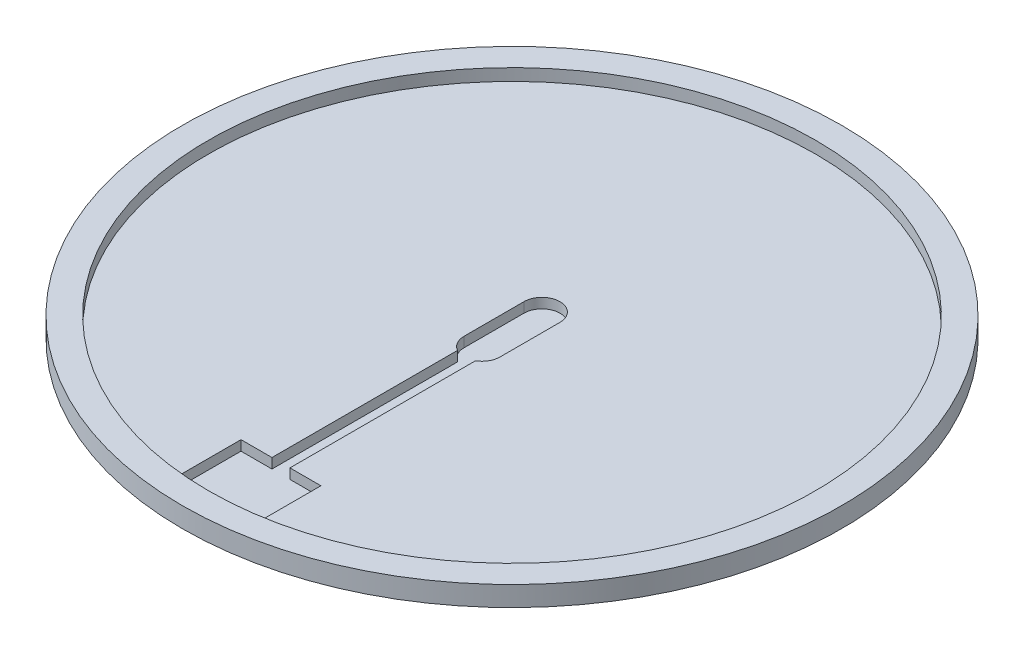
ISO-10303-21;
HEADER;
FILE_DESCRIPTION(('STEP AP214'),'2;1');
FILE_NAME('part.step','',(''),(''),'','','');
FILE_SCHEMA(('AUTOMOTIVE_DESIGN { 1 0 10303 214 1 1 1 1 }'));
ENDSEC;
DATA;
#1=APPLICATION_CONTEXT('core data for automotive mechanical design processes');
#2=APPLICATION_PROTOCOL_DEFINITION('international standard','automotive_design',2000,#1);
#3=PRODUCT_CONTEXT('',#1,'mechanical');
#4=PRODUCT('Part','Part','',(#3));
#5=PRODUCT_RELATED_PRODUCT_CATEGORY('part','',(#4));
#6=PRODUCT_DEFINITION_FORMATION('','',#4);
#7=PRODUCT_DEFINITION_CONTEXT('part definition',#1,'design');
#8=PRODUCT_DEFINITION('design','',#6,#7);
#9=PRODUCT_DEFINITION_SHAPE('','',#8);
#10=(LENGTH_UNIT() NAMED_UNIT(*) SI_UNIT(.MILLI.,.METRE.));
#11=(NAMED_UNIT(*) PLANE_ANGLE_UNIT() SI_UNIT($,.RADIAN.));
#12=(NAMED_UNIT(*) SI_UNIT($,.STERADIAN.) SOLID_ANGLE_UNIT());
#13=UNCERTAINTY_MEASURE_WITH_UNIT(LENGTH_MEASURE(1.E-05),#10,'distance_accuracy_value','');
#14=(GEOMETRIC_REPRESENTATION_CONTEXT(3) GLOBAL_UNCERTAINTY_ASSIGNED_CONTEXT((#13)) GLOBAL_UNIT_ASSIGNED_CONTEXT((#10,
#11,#12)) REPRESENTATION_CONTEXT('',''));
#15=CARTESIAN_POINT('',(0.,0.,0.));
#16=DIRECTION('',(0.,0.,1.));
#17=DIRECTION('',(1.,0.,0.));
#18=AXIS2_PLACEMENT_3D('',#15,#16,#17);
#19=CARTESIAN_POINT('',(0.,13.,0.));
#20=DIRECTION('',(0.,-1.,0.));
#21=DIRECTION('',(0.,0.,-1.));
#22=AXIS2_PLACEMENT_3D('',#19,#20,#21);
#23=CYLINDRICAL_SURFACE('',#22,165.);
#24=CARTESIAN_POINT('',(0.,13.,0.));
#25=DIRECTION('',(0.,1.,0.));
#26=DIRECTION('',(0.,0.,1.));
#27=AXIS2_PLACEMENT_3D('',#24,#25,#26);
#28=CIRCLE('',#27,165.);
#29=CARTESIAN_POINT('',(0.,13.,165.));
#30=VERTEX_POINT('',#29);
#31=EDGE_CURVE('E240',#30,#30,#28,.T.);
#32=ORIENTED_EDGE('',*,*,#31,.F.);
#33=EDGE_LOOP('',(#32));
#34=FACE_BOUND('',#33,.T.);
#35=CARTESIAN_POINT('',(0.,3.,0.));
#36=DIRECTION('',(0.,-1.,0.));
#37=DIRECTION('',(0.,0.,-1.));
#38=AXIS2_PLACEMENT_3D('',#35,#36,#37);
#39=CIRCLE('',#38,165.);
#40=CARTESIAN_POINT('',(0.,3.,-165.));
#41=VERTEX_POINT('',#40);
#42=EDGE_CURVE('E234',#41,#41,#39,.T.);
#43=ORIENTED_EDGE('',*,*,#42,.F.);
#44=EDGE_LOOP('',(#43));
#45=FACE_BOUND('',#44,.T.);
#46=ADVANCED_FACE('F33',(#34,#45),#23,.T.);
#47=CARTESIAN_POINT('',(0.,13.,0.));
#48=DIRECTION('',(0.,1.,0.));
#49=DIRECTION('',(0.,0.,1.));
#50=AXIS2_PLACEMENT_3D('',#47,#48,#49);
#51=PLANE('',#50);
#52=CARTESIAN_POINT('',(0.,13.,0.));
#53=DIRECTION('',(0.,1.,0.));
#54=DIRECTION('',(0.,0.,1.));
#55=AXIS2_PLACEMENT_3D('',#52,#53,#54);
#56=CIRCLE('',#55,152.);
#57=CARTESIAN_POINT('',(0.,13.,152.));
#58=VERTEX_POINT('',#57);
#59=EDGE_CURVE('E227',#58,#58,#56,.T.);
#60=ORIENTED_EDGE('',*,*,#59,.F.);
#61=EDGE_LOOP('',(#60));
#62=FACE_BOUND('',#61,.T.);
#63=ORIENTED_EDGE('',*,*,#31,.T.);
#64=EDGE_LOOP('',(#63));
#65=FACE_BOUND('',#64,.T.);
#66=ADVANCED_FACE('F315',(#62,#65),#51,.T.);
#67=CARTESIAN_POINT('',(0.,3.,0.));
#68=DIRECTION('',(0.,-1.,0.));
#69=DIRECTION('',(0.,0.,-1.));
#70=AXIS2_PLACEMENT_3D('',#67,#68,#69);
#71=PLANE('',#70);
#72=DIRECTION('',(0.,0.,1.));
#73=VECTOR('',#72,1.);
#74=CARTESIAN_POINT('',(20.,3.,0.));
#75=LINE('',#74,#73);
#76=CARTESIAN_POINT('',(20.,3.,147.651616990807));
#77=VERTEX_POINT('',#76);
#78=CARTESIAN_POINT('',(20.,3.,150.678465614699));
#79=VERTEX_POINT('',#78);
#80=EDGE_CURVE('E225',#77,#79,#75,.T.);
#81=ORIENTED_EDGE('',*,*,#80,.F.);
#82=CARTESIAN_POINT('',(0.,3.,0.));
#83=DIRECTION('',(0.,-1.,0.));
#84=DIRECTION('',(0.,0.,-1.));
#85=AXIS2_PLACEMENT_3D('',#82,#83,#84);
#86=CIRCLE('',#85,149.);
#87=CARTESIAN_POINT('',(-20.,3.,147.651616990807));
#88=VERTEX_POINT('',#87);
#89=EDGE_CURVE('E231',#88,#77,#86,.T.);
#90=ORIENTED_EDGE('',*,*,#89,.F.);
#91=DIRECTION('',(0.,0.,-1.));
#92=VECTOR('',#91,1.);
#93=CARTESIAN_POINT('',(-20.,3.,0.));
#94=LINE('',#93,#92);
#95=CARTESIAN_POINT('',(-20.,3.,150.678465614699));
#96=VERTEX_POINT('',#95);
#97=EDGE_CURVE('E206',#96,#88,#94,.T.);
#98=ORIENTED_EDGE('',*,*,#97,.F.);
#99=CARTESIAN_POINT('',(0.,3.,0.));
#100=DIRECTION('',(0.,-1.,0.));
#101=DIRECTION('',(0.,0.,-1.));
#102=AXIS2_PLACEMENT_3D('',#99,#100,#101);
#103=CIRCLE('',#102,152.);
#104=EDGE_CURVE('E11',#79,#96,#103,.T.);
#105=ORIENTED_EDGE('',*,*,#104,.F.);
#106=EDGE_LOOP('',(#81,#90,#98,#105));
#107=FACE_BOUND('',#106,.T.);
#108=ORIENTED_EDGE('',*,*,#42,.T.);
#109=EDGE_LOOP('',(#108));
#110=FACE_BOUND('',#109,.T.);
#111=ADVANCED_FACE('F312',(#107,#110),#71,.T.);
#112=CARTESIAN_POINT('',(0.,3.,0.));
#113=DIRECTION('',(0.,-1.,0.));
#114=DIRECTION('',(0.,0.,-1.));
#115=AXIS2_PLACEMENT_3D('',#112,#113,#114);
#116=CYLINDRICAL_SURFACE('',#115,149.);
#117=DIRECTION('',(0.,-1.,0.));
#118=VECTOR('',#117,1.);
#119=CARTESIAN_POINT('',(20.,3.,147.651616990807));
#120=LINE('',#119,#118);
#121=CARTESIAN_POINT('',(20.,2.,147.651616990807));
#122=VERTEX_POINT('',#121);
#123=EDGE_CURVE('E42',#122,#77,#120,.F.);
#124=ORIENTED_EDGE('',*,*,#123,.F.);
#125=CARTESIAN_POINT('',(0.,2.,0.));
#126=DIRECTION('',(0.,-1.,0.));
#127=DIRECTION('',(0.,0.,-1.));
#128=AXIS2_PLACEMENT_3D('',#125,#126,#127);
#129=CIRCLE('',#128,149.);
#130=CARTESIAN_POINT('',(-20.,2.,147.651616990807));
#131=VERTEX_POINT('',#130);
#132=EDGE_CURVE('E243',#131,#122,#129,.F.);
#133=ORIENTED_EDGE('',*,*,#132,.F.);
#134=DIRECTION('',(0.,-1.,0.));
#135=VECTOR('',#134,1.);
#136=CARTESIAN_POINT('',(-20.,3.,147.651616990807));
#137=LINE('',#136,#135);
#138=EDGE_CURVE('E245',#88,#131,#137,.T.);
#139=ORIENTED_EDGE('',*,*,#138,.F.);
#140=ORIENTED_EDGE('',*,*,#89,.T.);
#141=EDGE_LOOP('',(#124,#133,#139,#140));
#142=FACE_BOUND('',#141,.T.);
#143=CARTESIAN_POINT('',(0.,0.,0.));
#144=DIRECTION('',(0.,-1.,0.));
#145=DIRECTION('',(0.,0.,-1.));
#146=AXIS2_PLACEMENT_3D('',#143,#144,#145);
#147=CIRCLE('',#146,149.);
#148=CARTESIAN_POINT('',(0.,0.,-149.));
#149=VERTEX_POINT('',#148);
#150=EDGE_CURVE('E235',#149,#149,#147,.T.);
#151=ORIENTED_EDGE('',*,*,#150,.F.);
#152=EDGE_LOOP('',(#151));
#153=FACE_BOUND('',#152,.T.);
#154=ADVANCED_FACE('F307',(#142,#153),#116,.T.);
#155=CARTESIAN_POINT('',(0.,0.,0.));
#156=DIRECTION('',(0.,1.,0.));
#157=DIRECTION('',(0.,0.,1.));
#158=AXIS2_PLACEMENT_3D('',#155,#156,#157);
#159=PLANE('',#158);
#160=ORIENTED_EDGE('',*,*,#150,.T.);
#161=EDGE_LOOP('',(#160));
#162=FACE_BOUND('',#161,.T.);
#163=ADVANCED_FACE('F332',(#162),#159,.F.);
#164=CARTESIAN_POINT('',(0.,7.,0.));
#165=DIRECTION('',(0.,1.,0.));
#166=DIRECTION('',(0.,0.,1.));
#167=AXIS2_PLACEMENT_3D('',#164,#165,#166);
#168=CYLINDRICAL_SURFACE('',#167,152.);
#169=CARTESIAN_POINT('',(0.,7.,0.));
#170=DIRECTION('',(0.,1.,0.));
#171=DIRECTION('',(0.,0.,1.));
#172=AXIS2_PLACEMENT_3D('',#169,#170,#171);
#173=CIRCLE('',#172,152.);
#174=CARTESIAN_POINT('',(20.,7.,150.678465614699));
#175=VERTEX_POINT('',#174);
#176=CARTESIAN_POINT('',(-20.,7.,150.678465614699));
#177=VERTEX_POINT('',#176);
#178=EDGE_CURVE('E230',#175,#177,#173,.T.);
#179=ORIENTED_EDGE('',*,*,#178,.F.);
#180=DIRECTION('',(0.,1.,0.));
#181=VECTOR('',#180,1.);
#182=CARTESIAN_POINT('',(20.,2.,150.678465614699));
#183=LINE('',#182,#181);
#184=EDGE_CURVE('E215',#79,#175,#183,.T.);
#185=ORIENTED_EDGE('',*,*,#184,.F.);
#186=ORIENTED_EDGE('',*,*,#104,.T.);
#187=DIRECTION('',(0.,1.,0.));
#188=VECTOR('',#187,1.);
#189=CARTESIAN_POINT('',(-20.,2.,150.678465614699));
#190=LINE('',#189,#188);
#191=EDGE_CURVE('E218',#96,#177,#190,.T.);
#192=ORIENTED_EDGE('',*,*,#191,.T.);
#193=EDGE_LOOP('',(#179,#185,#186,#192));
#194=FACE_BOUND('',#193,.T.);
#195=ORIENTED_EDGE('',*,*,#59,.T.);
#196=EDGE_LOOP('',(#195));
#197=FACE_BOUND('',#196,.T.);
#198=ADVANCED_FACE('F275',(#194,#197),#168,.F.);
#199=CARTESIAN_POINT('',(0.,7.,0.));
#200=DIRECTION('',(0.,1.,0.));
#201=DIRECTION('',(0.,0.,1.));
#202=AXIS2_PLACEMENT_3D('',#199,#200,#201);
#203=PLANE('',#202);
#204=DIRECTION('',(0.,0.,1.));
#205=VECTOR('',#204,1.);
#206=CARTESIAN_POINT('',(-20.,7.,115.678465614699));
#207=LINE('',#206,#205);
#208=CARTESIAN_POINT('',(-20.,7.,115.678465614699));
#209=VERTEX_POINT('',#208);
#210=EDGE_CURVE('E194',#209,#177,#207,.T.);
#211=ORIENTED_EDGE('',*,*,#210,.F.);
#212=DIRECTION('',(-1.,0.,0.));
#213=VECTOR('',#212,1.);
#214=CARTESIAN_POINT('',(-4.5,7.,115.678465614699));
#215=LINE('',#214,#213);
#216=CARTESIAN_POINT('',(-4.5,7.,115.678465614699));
#217=VERTEX_POINT('',#216);
#218=EDGE_CURVE('E192',#217,#209,#215,.T.);
#219=ORIENTED_EDGE('',*,*,#218,.F.);
#220=DIRECTION('',(0.,0.,1.));
#221=VECTOR('',#220,1.);
#222=CARTESIAN_POINT('',(-4.5,7.,115.678465614699));
#223=LINE('',#222,#221);
#224=CARTESIAN_POINT('',(-4.5,7.,22.7942286340599));
#225=VERTEX_POINT('',#224);
#226=EDGE_CURVE('E189',#225,#217,#223,.T.);
#227=ORIENTED_EDGE('',*,*,#226,.F.);
#228=CARTESIAN_POINT('',(0.,7.,15.));
#229=DIRECTION('',(0.,1.,0.));
#230=DIRECTION('',(0.,0.,1.));
#231=AXIS2_PLACEMENT_3D('',#228,#229,#230);
#232=CIRCLE('',#231,9.);
#233=CARTESIAN_POINT('',(-9.,7.,15.));
#234=VERTEX_POINT('',#233);
#235=EDGE_CURVE('E186',#234,#225,#232,.T.);
#236=ORIENTED_EDGE('',*,*,#235,.F.);
#237=DIRECTION('',(0.,0.,1.));
#238=VECTOR('',#237,1.);
#239=CARTESIAN_POINT('',(-9.,7.,15.));
#240=LINE('',#239,#238);
#241=CARTESIAN_POINT('',(-9.,7.,-15.));
#242=VERTEX_POINT('',#241);
#243=EDGE_CURVE('E184',#242,#234,#240,.T.);
#244=ORIENTED_EDGE('',*,*,#243,.F.);
#245=CARTESIAN_POINT('',(0.,7.,-15.));
#246=DIRECTION('',(0.,1.,0.));
#247=DIRECTION('',(0.,0.,-1.));
#248=AXIS2_PLACEMENT_3D('',#245,#246,#247);
#249=CIRCLE('',#248,9.);
#250=CARTESIAN_POINT('',(9.,7.,-15.));
#251=VERTEX_POINT('',#250);
#252=EDGE_CURVE('E143',#251,#242,#249,.T.);
#253=ORIENTED_EDGE('',*,*,#252,.F.);
#254=DIRECTION('',(0.,0.,-1.));
#255=VECTOR('',#254,1.);
#256=CARTESIAN_POINT('',(9.,7.,15.));
#257=LINE('',#256,#255);
#258=CARTESIAN_POINT('',(9.,7.,15.));
#259=VERTEX_POINT('',#258);
#260=EDGE_CURVE('E160',#259,#251,#257,.T.);
#261=ORIENTED_EDGE('',*,*,#260,.F.);
#262=CARTESIAN_POINT('',(0.,7.,15.));
#263=DIRECTION('',(0.,1.,0.));
#264=DIRECTION('',(0.,0.,1.));
#265=AXIS2_PLACEMENT_3D('',#262,#263,#264);
#266=CIRCLE('',#265,9.);
#267=CARTESIAN_POINT('',(4.5,7.,22.7942286340599));
#268=VERTEX_POINT('',#267);
#269=EDGE_CURVE('E50',#268,#259,#266,.T.);
#270=ORIENTED_EDGE('',*,*,#269,.F.);
#271=DIRECTION('',(0.,0.,-1.));
#272=VECTOR('',#271,1.);
#273=CARTESIAN_POINT('',(4.5,7.,115.678465614699));
#274=LINE('',#273,#272);
#275=CARTESIAN_POINT('',(4.5,7.,115.678465614699));
#276=VERTEX_POINT('',#275);
#277=EDGE_CURVE('E200',#276,#268,#274,.T.);
#278=ORIENTED_EDGE('',*,*,#277,.F.);
#279=DIRECTION('',(-1.,0.,0.));
#280=VECTOR('',#279,1.);
#281=CARTESIAN_POINT('',(4.5,7.,115.678465614699));
#282=LINE('',#281,#280);
#283=CARTESIAN_POINT('',(20.,7.,115.678465614699));
#284=VERTEX_POINT('',#283);
#285=EDGE_CURVE('E197',#284,#276,#282,.T.);
#286=ORIENTED_EDGE('',*,*,#285,.F.);
#287=DIRECTION('',(0.,0.,-1.));
#288=VECTOR('',#287,1.);
#289=CARTESIAN_POINT('',(20.,7.,115.678465614699));
#290=LINE('',#289,#288);
#291=EDGE_CURVE('E36',#175,#284,#290,.T.);
#292=ORIENTED_EDGE('',*,*,#291,.F.);
#293=ORIENTED_EDGE('',*,*,#178,.T.);
#294=EDGE_LOOP('',(#211,#219,#227,#236,#244,#253,#261,#270,#278,#286,#292,#293));
#295=FACE_BOUND('',#294,.T.);
#296=ADVANCED_FACE('F273',(#295),#203,.T.);
#297=CARTESIAN_POINT('',(0.,2.,-15.));
#298=DIRECTION('',(0.,1.,0.));
#299=DIRECTION('',(0.,0.,1.));
#300=AXIS2_PLACEMENT_3D('',#297,#298,#299);
#301=CYLINDRICAL_SURFACE('',#300,9.);
#302=ORIENTED_EDGE('',*,*,#252,.T.);
#303=DIRECTION('',(0.,1.,0.));
#304=VECTOR('',#303,1.);
#305=CARTESIAN_POINT('',(-9.,2.,-15.));
#306=LINE('',#305,#304);
#307=CARTESIAN_POINT('',(-9.,2.,-15.));
#308=VERTEX_POINT('',#307);
#309=EDGE_CURVE('E136',#308,#242,#306,.T.);
#310=ORIENTED_EDGE('',*,*,#309,.F.);
#311=CARTESIAN_POINT('',(0.,2.,-15.));
#312=DIRECTION('',(0.,1.,0.));
#313=DIRECTION('',(0.,0.,-1.));
#314=AXIS2_PLACEMENT_3D('',#311,#312,#313);
#315=CIRCLE('',#314,9.);
#316=CARTESIAN_POINT('',(9.,2.,-15.));
#317=VERTEX_POINT('',#316);
#318=EDGE_CURVE('E140',#317,#308,#315,.T.);
#319=ORIENTED_EDGE('',*,*,#318,.F.);
#320=DIRECTION('',(0.,1.,0.));
#321=VECTOR('',#320,1.);
#322=CARTESIAN_POINT('',(9.,2.,-15.));
#323=LINE('',#322,#321);
#324=EDGE_CURVE('E204',#317,#251,#323,.T.);
#325=ORIENTED_EDGE('',*,*,#324,.T.);
#326=EDGE_LOOP('',(#302,#310,#319,#325));
#327=FACE_BOUND('',#326,.T.);
#328=ADVANCED_FACE('F138',(#327),#301,.F.);
#329=CARTESIAN_POINT('',(9.,2.,15.));
#330=DIRECTION('',(1.,0.,0.));
#331=DIRECTION('',(0.,0.,-1.));
#332=AXIS2_PLACEMENT_3D('',#329,#330,#331);
#333=PLANE('',#332);
#334=ORIENTED_EDGE('',*,*,#260,.T.);
#335=ORIENTED_EDGE('',*,*,#324,.F.);
#336=DIRECTION('',(0.,0.,-1.));
#337=VECTOR('',#336,1.);
#338=CARTESIAN_POINT('',(9.,2.,15.));
#339=LINE('',#338,#337);
#340=CARTESIAN_POINT('',(9.,2.,15.));
#341=VERTEX_POINT('',#340);
#342=EDGE_CURVE('E148',#341,#317,#339,.T.);
#343=ORIENTED_EDGE('',*,*,#342,.F.);
#344=DIRECTION('',(0.,1.,0.));
#345=VECTOR('',#344,1.);
#346=CARTESIAN_POINT('',(9.,2.,15.));
#347=LINE('',#346,#345);
#348=EDGE_CURVE('E207',#341,#259,#347,.T.);
#349=ORIENTED_EDGE('',*,*,#348,.T.);
#350=EDGE_LOOP('',(#334,#335,#343,#349));
#351=FACE_BOUND('',#350,.T.);
#352=ADVANCED_FACE('F294',(#351),#333,.F.);
#353=CARTESIAN_POINT('',(0.,2.,15.));
#354=DIRECTION('',(0.,1.,0.));
#355=DIRECTION('',(0.,0.,1.));
#356=AXIS2_PLACEMENT_3D('',#353,#354,#355);
#357=CYLINDRICAL_SURFACE('',#356,9.);
#358=ORIENTED_EDGE('',*,*,#269,.T.);
#359=ORIENTED_EDGE('',*,*,#348,.F.);
#360=CARTESIAN_POINT('',(0.,2.,15.));
#361=DIRECTION('',(0.,1.,0.));
#362=DIRECTION('',(0.,0.,1.));
#363=AXIS2_PLACEMENT_3D('',#360,#361,#362);
#364=CIRCLE('',#363,9.);
#365=CARTESIAN_POINT('',(4.5,2.,22.7942286340599));
#366=VERTEX_POINT('',#365);
#367=EDGE_CURVE('E180',#366,#341,#364,.T.);
#368=ORIENTED_EDGE('',*,*,#367,.F.);
#369=DIRECTION('',(0.,1.,0.));
#370=VECTOR('',#369,1.);
#371=CARTESIAN_POINT('',(4.5,2.,22.7942286340599));
#372=LINE('',#371,#370);
#373=EDGE_CURVE('E209',#366,#268,#372,.T.);
#374=ORIENTED_EDGE('',*,*,#373,.T.);
#375=EDGE_LOOP('',(#358,#359,#368,#374));
#376=FACE_BOUND('',#375,.T.);
#377=ADVANCED_FACE('F296',(#376),#357,.F.);
#378=CARTESIAN_POINT('',(4.5,2.,115.678465614699));
#379=DIRECTION('',(1.,0.,0.));
#380=DIRECTION('',(0.,0.,-1.));
#381=AXIS2_PLACEMENT_3D('',#378,#379,#380);
#382=PLANE('',#381);
#383=ORIENTED_EDGE('',*,*,#277,.T.);
#384=ORIENTED_EDGE('',*,*,#373,.F.);
#385=DIRECTION('',(0.,0.,-1.));
#386=VECTOR('',#385,1.);
#387=CARTESIAN_POINT('',(4.5,2.,115.678465614699));
#388=LINE('',#387,#386);
#389=CARTESIAN_POINT('',(4.5,2.,115.678465614699));
#390=VERTEX_POINT('',#389);
#391=EDGE_CURVE('E177',#390,#366,#388,.T.);
#392=ORIENTED_EDGE('',*,*,#391,.F.);
#393=DIRECTION('',(0.,1.,0.));
#394=VECTOR('',#393,1.);
#395=CARTESIAN_POINT('',(4.5,2.,115.678465614699));
#396=LINE('',#395,#394);
#397=EDGE_CURVE('E211',#390,#276,#396,.T.);
#398=ORIENTED_EDGE('',*,*,#397,.T.);
#399=EDGE_LOOP('',(#383,#384,#392,#398));
#400=FACE_BOUND('',#399,.T.);
#401=ADVANCED_FACE('F300',(#400),#382,.F.);
#402=CARTESIAN_POINT('',(4.5,2.,115.678465614699));
#403=DIRECTION('',(0.,0.,-1.));
#404=DIRECTION('',(-1.,0.,0.));
#405=AXIS2_PLACEMENT_3D('',#402,#403,#404);
#406=PLANE('',#405);
#407=ORIENTED_EDGE('',*,*,#285,.T.);
#408=ORIENTED_EDGE('',*,*,#397,.F.);
#409=DIRECTION('',(-1.,0.,0.));
#410=VECTOR('',#409,1.);
#411=CARTESIAN_POINT('',(4.5,2.,115.678465614699));
#412=LINE('',#411,#410);
#413=CARTESIAN_POINT('',(20.,2.,115.678465614699));
#414=VERTEX_POINT('',#413);
#415=EDGE_CURVE('E174',#414,#390,#412,.T.);
#416=ORIENTED_EDGE('',*,*,#415,.F.);
#417=DIRECTION('',(0.,1.,0.));
#418=VECTOR('',#417,1.);
#419=CARTESIAN_POINT('',(20.,2.,115.678465614699));
#420=LINE('',#419,#418);
#421=EDGE_CURVE('E213',#414,#284,#420,.T.);
#422=ORIENTED_EDGE('',*,*,#421,.T.);
#423=EDGE_LOOP('',(#407,#408,#416,#422));
#424=FACE_BOUND('',#423,.T.);
#425=ADVANCED_FACE('F302',(#424),#406,.F.);
#426=CARTESIAN_POINT('',(20.,2.,115.678465614699));
#427=DIRECTION('',(1.,0.,0.));
#428=DIRECTION('',(0.,0.,-1.));
#429=AXIS2_PLACEMENT_3D('',#426,#427,#428);
#430=PLANE('',#429);
#431=ORIENTED_EDGE('',*,*,#80,.T.);
#432=ORIENTED_EDGE('',*,*,#184,.T.);
#433=ORIENTED_EDGE('',*,*,#291,.T.);
#434=ORIENTED_EDGE('',*,*,#421,.F.);
#435=DIRECTION('',(0.,0.,-1.));
#436=VECTOR('',#435,1.);
#437=CARTESIAN_POINT('',(20.,2.,115.678465614699));
#438=LINE('',#437,#436);
#439=EDGE_CURVE('E172',#122,#414,#438,.T.);
#440=ORIENTED_EDGE('',*,*,#439,.F.);
#441=ORIENTED_EDGE('',*,*,#123,.T.);
#442=EDGE_LOOP('',(#431,#432,#433,#434,#440,#441));
#443=FACE_BOUND('',#442,.T.);
#444=ADVANCED_FACE('F264',(#443),#430,.F.);
#445=CARTESIAN_POINT('',(-20.,2.,115.678465614699));
#446=DIRECTION('',(-1.,0.,0.));
#447=DIRECTION('',(0.,0.,1.));
#448=AXIS2_PLACEMENT_3D('',#445,#446,#447);
#449=PLANE('',#448);
#450=ORIENTED_EDGE('',*,*,#97,.T.);
#451=ORIENTED_EDGE('',*,*,#138,.T.);
#452=DIRECTION('',(0.,0.,1.));
#453=VECTOR('',#452,1.);
#454=CARTESIAN_POINT('',(-20.,2.,115.678465614699));
#455=LINE('',#454,#453);
#456=CARTESIAN_POINT('',(-20.,2.,115.678465614699));
#457=VERTEX_POINT('',#456);
#458=EDGE_CURVE('E58',#457,#131,#455,.T.);
#459=ORIENTED_EDGE('',*,*,#458,.F.);
#460=DIRECTION('',(0.,1.,0.));
#461=VECTOR('',#460,1.);
#462=CARTESIAN_POINT('',(-20.,2.,115.678465614699));
#463=LINE('',#462,#461);
#464=EDGE_CURVE('E216',#457,#209,#463,.T.);
#465=ORIENTED_EDGE('',*,*,#464,.T.);
#466=ORIENTED_EDGE('',*,*,#210,.T.);
#467=ORIENTED_EDGE('',*,*,#191,.F.);
#468=EDGE_LOOP('',(#450,#451,#459,#465,#466,#467));
#469=FACE_BOUND('',#468,.T.);
#470=ADVANCED_FACE('F280',(#469),#449,.F.);
#471=CARTESIAN_POINT('',(-4.5,2.,115.678465614699));
#472=DIRECTION('',(0.,0.,-1.));
#473=DIRECTION('',(-1.,0.,0.));
#474=AXIS2_PLACEMENT_3D('',#471,#472,#473);
#475=PLANE('',#474);
#476=ORIENTED_EDGE('',*,*,#218,.T.);
#477=ORIENTED_EDGE('',*,*,#464,.F.);
#478=DIRECTION('',(-1.,0.,0.));
#479=VECTOR('',#478,1.);
#480=CARTESIAN_POINT('',(-4.5,2.,115.678465614699));
#481=LINE('',#480,#479);
#482=CARTESIAN_POINT('',(-4.5,2.,115.678465614699));
#483=VERTEX_POINT('',#482);
#484=EDGE_CURVE('E169',#483,#457,#481,.T.);
#485=ORIENTED_EDGE('',*,*,#484,.F.);
#486=DIRECTION('',(0.,1.,0.));
#487=VECTOR('',#486,1.);
#488=CARTESIAN_POINT('',(-4.5,2.,115.678465614699));
#489=LINE('',#488,#487);
#490=EDGE_CURVE('E219',#483,#217,#489,.T.);
#491=ORIENTED_EDGE('',*,*,#490,.T.);
#492=EDGE_LOOP('',(#476,#477,#485,#491));
#493=FACE_BOUND('',#492,.T.);
#494=ADVANCED_FACE('F285',(#493),#475,.F.);
#495=CARTESIAN_POINT('',(-4.5,2.,115.678465614699));
#496=DIRECTION('',(-1.,0.,0.));
#497=DIRECTION('',(0.,0.,1.));
#498=AXIS2_PLACEMENT_3D('',#495,#496,#497);
#499=PLANE('',#498);
#500=ORIENTED_EDGE('',*,*,#226,.T.);
#501=ORIENTED_EDGE('',*,*,#490,.F.);
#502=DIRECTION('',(0.,0.,1.));
#503=VECTOR('',#502,1.);
#504=CARTESIAN_POINT('',(-4.5,2.,115.678465614699));
#505=LINE('',#504,#503);
#506=CARTESIAN_POINT('',(-4.5,2.,22.7942286340599));
#507=VERTEX_POINT('',#506);
#508=EDGE_CURVE('E166',#507,#483,#505,.T.);
#509=ORIENTED_EDGE('',*,*,#508,.F.);
#510=DIRECTION('',(0.,1.,0.));
#511=VECTOR('',#510,1.);
#512=CARTESIAN_POINT('',(-4.5,2.,22.7942286340599));
#513=LINE('',#512,#511);
#514=EDGE_CURVE('E221',#507,#225,#513,.T.);
#515=ORIENTED_EDGE('',*,*,#514,.T.);
#516=EDGE_LOOP('',(#500,#501,#509,#515));
#517=FACE_BOUND('',#516,.T.);
#518=ADVANCED_FACE('F289',(#517),#499,.F.);
#519=CARTESIAN_POINT('',(0.,2.,15.));
#520=DIRECTION('',(0.,1.,0.));
#521=DIRECTION('',(0.,0.,1.));
#522=AXIS2_PLACEMENT_3D('',#519,#520,#521);
#523=CYLINDRICAL_SURFACE('',#522,9.);
#524=ORIENTED_EDGE('',*,*,#235,.T.);
#525=ORIENTED_EDGE('',*,*,#514,.F.);
#526=CARTESIAN_POINT('',(0.,2.,15.));
#527=DIRECTION('',(0.,1.,0.));
#528=DIRECTION('',(0.,0.,1.));
#529=AXIS2_PLACEMENT_3D('',#526,#527,#528);
#530=CIRCLE('',#529,9.);
#531=CARTESIAN_POINT('',(-9.,2.,15.));
#532=VERTEX_POINT('',#531);
#533=EDGE_CURVE('E155',#532,#507,#530,.T.);
#534=ORIENTED_EDGE('',*,*,#533,.F.);
#535=DIRECTION('',(0.,1.,0.));
#536=VECTOR('',#535,1.);
#537=CARTESIAN_POINT('',(-9.,2.,15.));
#538=LINE('',#537,#536);
#539=EDGE_CURVE('E147',#532,#234,#538,.T.);
#540=ORIENTED_EDGE('',*,*,#539,.T.);
#541=EDGE_LOOP('',(#524,#525,#534,#540));
#542=FACE_BOUND('',#541,.T.);
#543=ADVANCED_FACE('F291',(#542),#523,.F.);
#544=CARTESIAN_POINT('',(-9.,2.,15.));
#545=DIRECTION('',(-1.,0.,0.));
#546=DIRECTION('',(0.,0.,1.));
#547=AXIS2_PLACEMENT_3D('',#544,#545,#546);
#548=PLANE('',#547);
#549=ORIENTED_EDGE('',*,*,#243,.T.);
#550=ORIENTED_EDGE('',*,*,#539,.F.);
#551=DIRECTION('',(0.,0.,1.));
#552=VECTOR('',#551,1.);
#553=CARTESIAN_POINT('',(-9.,2.,15.));
#554=LINE('',#553,#552);
#555=EDGE_CURVE('E151',#308,#532,#554,.T.);
#556=ORIENTED_EDGE('',*,*,#555,.F.);
#557=ORIENTED_EDGE('',*,*,#309,.T.);
#558=EDGE_LOOP('',(#549,#550,#556,#557));
#559=FACE_BOUND('',#558,.T.);
#560=ADVANCED_FACE('F152',(#559),#548,.F.);
#561=CARTESIAN_POINT('',(0.,2.,-15.));
#562=DIRECTION('',(0.,-1.,0.));
#563=DIRECTION('',(0.,0.,-1.));
#564=AXIS2_PLACEMENT_3D('',#561,#562,#563);
#565=PLANE('',#564);
#566=ORIENTED_EDGE('',*,*,#132,.T.);
#567=ORIENTED_EDGE('',*,*,#439,.T.);
#568=ORIENTED_EDGE('',*,*,#415,.T.);
#569=ORIENTED_EDGE('',*,*,#391,.T.);
#570=ORIENTED_EDGE('',*,*,#367,.T.);
#571=ORIENTED_EDGE('',*,*,#342,.T.);
#572=ORIENTED_EDGE('',*,*,#318,.T.);
#573=ORIENTED_EDGE('',*,*,#555,.T.);
#574=ORIENTED_EDGE('',*,*,#533,.T.);
#575=ORIENTED_EDGE('',*,*,#508,.T.);
#576=ORIENTED_EDGE('',*,*,#484,.T.);
#577=ORIENTED_EDGE('',*,*,#458,.T.);
#578=EDGE_LOOP('',(#566,#567,#568,#569,#570,#571,#572,#573,#574,#575,#576,#577));
#579=FACE_BOUND('',#578,.T.);
#580=ADVANCED_FACE('F157',(#579),#565,.F.);
#581=CLOSED_SHELL('',(#46,#66,#111,#154,#163,#198,#296,#328,#352,#377,#401,#425,#444,#470,#494,
#518,#543,#560,#580));
#582=MANIFOLD_SOLID_BREP('B2',#581);
#583=ADVANCED_BREP_SHAPE_REPRESENTATION('',(#18,#582),#14);
#584=SHAPE_DEFINITION_REPRESENTATION(#9,#583);
ENDSEC;
END-ISO-10303-21;
